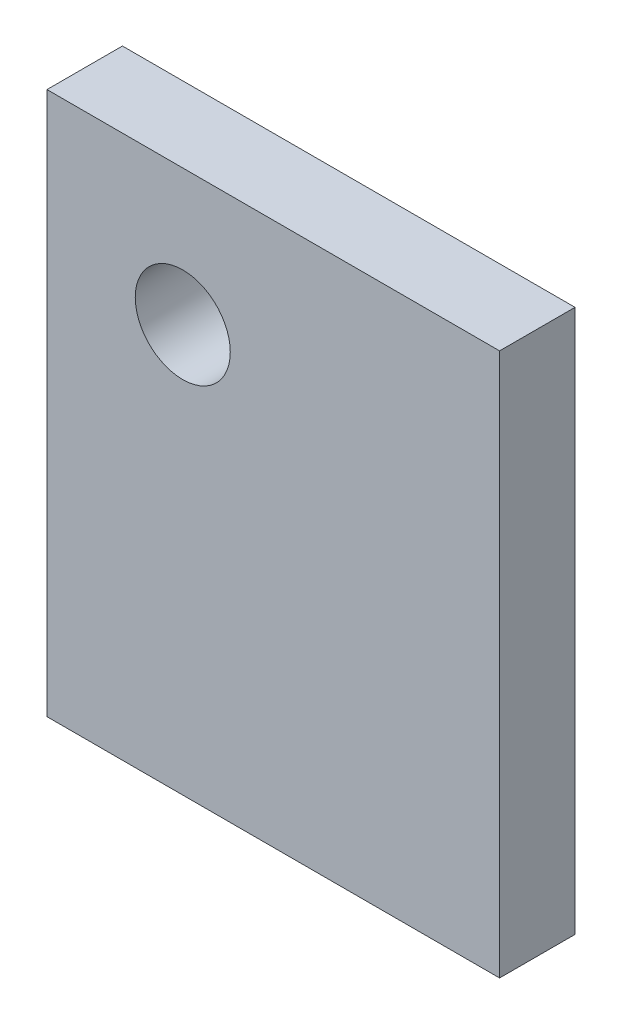
ISO-10303-21;
HEADER;
FILE_DESCRIPTION(('STEP AP214'),'2;1');
FILE_NAME('part.step','',(''),(''),'','','');
FILE_SCHEMA(('AUTOMOTIVE_DESIGN { 1 0 10303 214 1 1 1 1 }'));
ENDSEC;
DATA;
#1=APPLICATION_CONTEXT('core data for automotive mechanical design processes');
#2=APPLICATION_PROTOCOL_DEFINITION('international standard','automotive_design',2000,#1);
#3=PRODUCT_CONTEXT('',#1,'mechanical');
#4=PRODUCT('Part','Part','',(#3));
#5=PRODUCT_RELATED_PRODUCT_CATEGORY('part','',(#4));
#6=PRODUCT_DEFINITION_FORMATION('','',#4);
#7=PRODUCT_DEFINITION_CONTEXT('part definition',#1,'design');
#8=PRODUCT_DEFINITION('design','',#6,#7);
#9=PRODUCT_DEFINITION_SHAPE('','',#8);
#10=(LENGTH_UNIT() NAMED_UNIT(*) SI_UNIT(.MILLI.,.METRE.));
#11=(NAMED_UNIT(*) PLANE_ANGLE_UNIT() SI_UNIT($,.RADIAN.));
#12=(NAMED_UNIT(*) SI_UNIT($,.STERADIAN.) SOLID_ANGLE_UNIT());
#13=UNCERTAINTY_MEASURE_WITH_UNIT(LENGTH_MEASURE(1.E-05),#10,'distance_accuracy_value','');
#14=(GEOMETRIC_REPRESENTATION_CONTEXT(3) GLOBAL_UNCERTAINTY_ASSIGNED_CONTEXT((#13)) GLOBAL_UNIT_ASSIGNED_CONTEXT((#10,
#11,#12)) REPRESENTATION_CONTEXT('',''));
#15=CARTESIAN_POINT('',(0.,0.,0.));
#16=DIRECTION('',(0.,0.,1.));
#17=DIRECTION('',(1.,0.,0.));
#18=AXIS2_PLACEMENT_3D('',#15,#16,#17);
#19=CARTESIAN_POINT('',(0.,0.,6.35));
#20=DIRECTION('',(1.,0.,0.));
#21=DIRECTION('',(0.,0.,-1.));
#22=AXIS2_PLACEMENT_3D('',#19,#20,#21);
#23=PLANE('',#22);
#24=DIRECTION('',(0.,-1.,0.));
#25=VECTOR('',#24,1.);
#26=CARTESIAN_POINT('',(0.,0.,0.));
#27=LINE('',#26,#25);
#28=CARTESIAN_POINT('',(0.,45.72,0.));
#29=VERTEX_POINT('',#28);
#30=CARTESIAN_POINT('',(0.,0.,0.));
#31=VERTEX_POINT('',#30);
#32=EDGE_CURVE('E100',#29,#31,#27,.T.);
#33=ORIENTED_EDGE('',*,*,#32,.T.);
#34=DIRECTION('',(0.,0.,-1.));
#35=VECTOR('',#34,1.);
#36=CARTESIAN_POINT('',(0.,0.,6.35));
#37=LINE('',#36,#35);
#38=CARTESIAN_POINT('',(0.,0.,6.35));
#39=VERTEX_POINT('',#38);
#40=EDGE_CURVE('E11',#39,#31,#37,.T.);
#41=ORIENTED_EDGE('',*,*,#40,.F.);
#42=DIRECTION('',(0.,-1.,0.));
#43=VECTOR('',#42,1.);
#44=CARTESIAN_POINT('',(0.,0.,6.35));
#45=LINE('',#44,#43);
#46=CARTESIAN_POINT('',(0.,45.72,6.35));
#47=VERTEX_POINT('',#46);
#48=EDGE_CURVE('E87',#47,#39,#45,.T.);
#49=ORIENTED_EDGE('',*,*,#48,.F.);
#50=DIRECTION('',(0.,0.,-1.));
#51=VECTOR('',#50,1.);
#52=CARTESIAN_POINT('',(0.,45.72,6.35));
#53=LINE('',#52,#51);
#54=EDGE_CURVE('E96',#47,#29,#53,.T.);
#55=ORIENTED_EDGE('',*,*,#54,.T.);
#56=EDGE_LOOP('',(#33,#41,#49,#55));
#57=FACE_BOUND('',#56,.T.);
#58=ADVANCED_FACE('F36',(#57),#23,.F.);
#59=CARTESIAN_POINT('',(0.,0.,6.35));
#60=DIRECTION('',(0.,1.,0.));
#61=DIRECTION('',(0.,0.,1.));
#62=AXIS2_PLACEMENT_3D('',#59,#60,#61);
#63=PLANE('',#62);
#64=DIRECTION('',(1.,0.,0.));
#65=VECTOR('',#64,1.);
#66=CARTESIAN_POINT('',(0.,0.,0.));
#67=LINE('',#66,#65);
#68=CARTESIAN_POINT('',(38.1,0.,0.));
#69=VERTEX_POINT('',#68);
#70=EDGE_CURVE('E91',#31,#69,#67,.T.);
#71=ORIENTED_EDGE('',*,*,#70,.T.);
#72=DIRECTION('',(0.,0.,-1.));
#73=VECTOR('',#72,1.);
#74=CARTESIAN_POINT('',(38.1,0.,6.35));
#75=LINE('',#74,#73);
#76=CARTESIAN_POINT('',(38.1,0.,6.35));
#77=VERTEX_POINT('',#76);
#78=EDGE_CURVE('E44',#77,#69,#75,.T.);
#79=ORIENTED_EDGE('',*,*,#78,.F.);
#80=DIRECTION('',(1.,0.,0.));
#81=VECTOR('',#80,1.);
#82=CARTESIAN_POINT('',(0.,0.,6.35));
#83=LINE('',#82,#81);
#84=EDGE_CURVE('E82',#39,#77,#83,.T.);
#85=ORIENTED_EDGE('',*,*,#84,.F.);
#86=ORIENTED_EDGE('',*,*,#40,.T.);
#87=EDGE_LOOP('',(#71,#79,#85,#86));
#88=FACE_BOUND('',#87,.T.);
#89=ADVANCED_FACE('F90',(#88),#63,.F.);
#90=CARTESIAN_POINT('',(38.1,0.,6.35));
#91=DIRECTION('',(-1.,0.,0.));
#92=DIRECTION('',(0.,0.,1.));
#93=AXIS2_PLACEMENT_3D('',#90,#91,#92);
#94=PLANE('',#93);
#95=DIRECTION('',(0.,1.,0.));
#96=VECTOR('',#95,1.);
#97=CARTESIAN_POINT('',(38.1,0.,0.));
#98=LINE('',#97,#96);
#99=CARTESIAN_POINT('',(38.1,45.72,0.));
#100=VERTEX_POINT('',#99);
#101=EDGE_CURVE('E69',#69,#100,#98,.T.);
#102=ORIENTED_EDGE('',*,*,#101,.T.);
#103=DIRECTION('',(0.,0.,-1.));
#104=VECTOR('',#103,1.);
#105=CARTESIAN_POINT('',(38.1,45.72,6.35));
#106=LINE('',#105,#104);
#107=CARTESIAN_POINT('',(38.1,45.72,6.35));
#108=VERTEX_POINT('',#107);
#109=EDGE_CURVE('E92',#108,#100,#106,.T.);
#110=ORIENTED_EDGE('',*,*,#109,.F.);
#111=DIRECTION('',(0.,1.,0.));
#112=VECTOR('',#111,1.);
#113=CARTESIAN_POINT('',(38.1,0.,6.35));
#114=LINE('',#113,#112);
#115=EDGE_CURVE('E85',#77,#108,#114,.T.);
#116=ORIENTED_EDGE('',*,*,#115,.F.);
#117=ORIENTED_EDGE('',*,*,#78,.T.);
#118=EDGE_LOOP('',(#102,#110,#116,#117));
#119=FACE_BOUND('',#118,.T.);
#120=ADVANCED_FACE('F93',(#119),#94,.F.);
#121=CARTESIAN_POINT('',(0.,45.72,6.35));
#122=DIRECTION('',(0.,-1.,0.));
#123=DIRECTION('',(0.,0.,-1.));
#124=AXIS2_PLACEMENT_3D('',#121,#122,#123);
#125=PLANE('',#124);
#126=DIRECTION('',(-1.,0.,0.));
#127=VECTOR('',#126,1.);
#128=CARTESIAN_POINT('',(0.,45.72,0.));
#129=LINE('',#128,#127);
#130=EDGE_CURVE('E75',#100,#29,#129,.T.);
#131=ORIENTED_EDGE('',*,*,#130,.T.);
#132=ORIENTED_EDGE('',*,*,#54,.F.);
#133=DIRECTION('',(-1.,0.,0.));
#134=VECTOR('',#133,1.);
#135=CARTESIAN_POINT('',(0.,45.72,6.35));
#136=LINE('',#135,#134);
#137=EDGE_CURVE('E52',#108,#47,#136,.T.);
#138=ORIENTED_EDGE('',*,*,#137,.F.);
#139=ORIENTED_EDGE('',*,*,#109,.T.);
#140=EDGE_LOOP('',(#131,#132,#138,#139));
#141=FACE_BOUND('',#140,.T.);
#142=ADVANCED_FACE('F108',(#141),#125,.F.);
#143=CARTESIAN_POINT('',(0.,0.,6.35));
#144=DIRECTION('',(0.,0.,-1.));
#145=DIRECTION('',(-1.,0.,0.));
#146=AXIS2_PLACEMENT_3D('',#143,#144,#145);
#147=PLANE('',#146);
#148=CARTESIAN_POINT('',(11.43,34.29,6.35));
#149=DIRECTION('',(0.,0.,-1.));
#150=DIRECTION('',(-1.,0.,0.));
#151=AXIS2_PLACEMENT_3D('',#148,#149,#150);
#152=CIRCLE('',#151,4.);
#153=CARTESIAN_POINT('',(7.43,34.29,6.35));
#154=VERTEX_POINT('',#153);
#155=EDGE_CURVE('E103',#154,#154,#152,.T.);
#156=ORIENTED_EDGE('',*,*,#155,.T.);
#157=EDGE_LOOP('',(#156));
#158=FACE_BOUND('',#157,.T.);
#159=ORIENTED_EDGE('',*,*,#48,.T.);
#160=ORIENTED_EDGE('',*,*,#84,.T.);
#161=ORIENTED_EDGE('',*,*,#115,.T.);
#162=ORIENTED_EDGE('',*,*,#137,.T.);
#163=EDGE_LOOP('',(#159,#160,#161,#162));
#164=FACE_BOUND('',#163,.T.);
#165=ADVANCED_FACE('F83',(#158,#164),#147,.F.);
#166=CARTESIAN_POINT('',(0.,0.,0.));
#167=DIRECTION('',(0.,0.,-1.));
#168=DIRECTION('',(-1.,0.,0.));
#169=AXIS2_PLACEMENT_3D('',#166,#167,#168);
#170=PLANE('',#169);
#171=CARTESIAN_POINT('',(11.43,34.29,0.));
#172=DIRECTION('',(0.,0.,1.));
#173=DIRECTION('',(1.,0.,0.));
#174=AXIS2_PLACEMENT_3D('',#171,#172,#173);
#175=CIRCLE('',#174,4.);
#176=CARTESIAN_POINT('',(15.43,34.29,0.));
#177=VERTEX_POINT('',#176);
#178=EDGE_CURVE('E116',#177,#177,#175,.T.);
#179=ORIENTED_EDGE('',*,*,#178,.T.);
#180=EDGE_LOOP('',(#179));
#181=FACE_BOUND('',#180,.T.);
#182=ORIENTED_EDGE('',*,*,#32,.F.);
#183=ORIENTED_EDGE('',*,*,#130,.F.);
#184=ORIENTED_EDGE('',*,*,#101,.F.);
#185=ORIENTED_EDGE('',*,*,#70,.F.);
#186=EDGE_LOOP('',(#182,#183,#184,#185));
#187=FACE_BOUND('',#186,.T.);
#188=ADVANCED_FACE('F111',(#181,#187),#170,.T.);
#189=CARTESIAN_POINT('',(11.43,34.29,0.));
#190=DIRECTION('',(0.,0.,1.));
#191=DIRECTION('',(1.,0.,0.));
#192=AXIS2_PLACEMENT_3D('',#189,#190,#191);
#193=CYLINDRICAL_SURFACE('',#192,4.);
#194=ORIENTED_EDGE('',*,*,#178,.F.);
#195=EDGE_LOOP('',(#194));
#196=FACE_BOUND('',#195,.T.);
#197=ORIENTED_EDGE('',*,*,#155,.F.);
#198=EDGE_LOOP('',(#197));
#199=FACE_BOUND('',#198,.T.);
#200=ADVANCED_FACE('F121',(#196,#199),#193,.F.);
#201=CLOSED_SHELL('',(#58,#89,#120,#142,#165,#188,#200));
#202=MANIFOLD_SOLID_BREP('B2',#201);
#203=ADVANCED_BREP_SHAPE_REPRESENTATION('',(#18,#202),#14);
#204=SHAPE_DEFINITION_REPRESENTATION(#9,#203);
ENDSEC;
END-ISO-10303-21;
